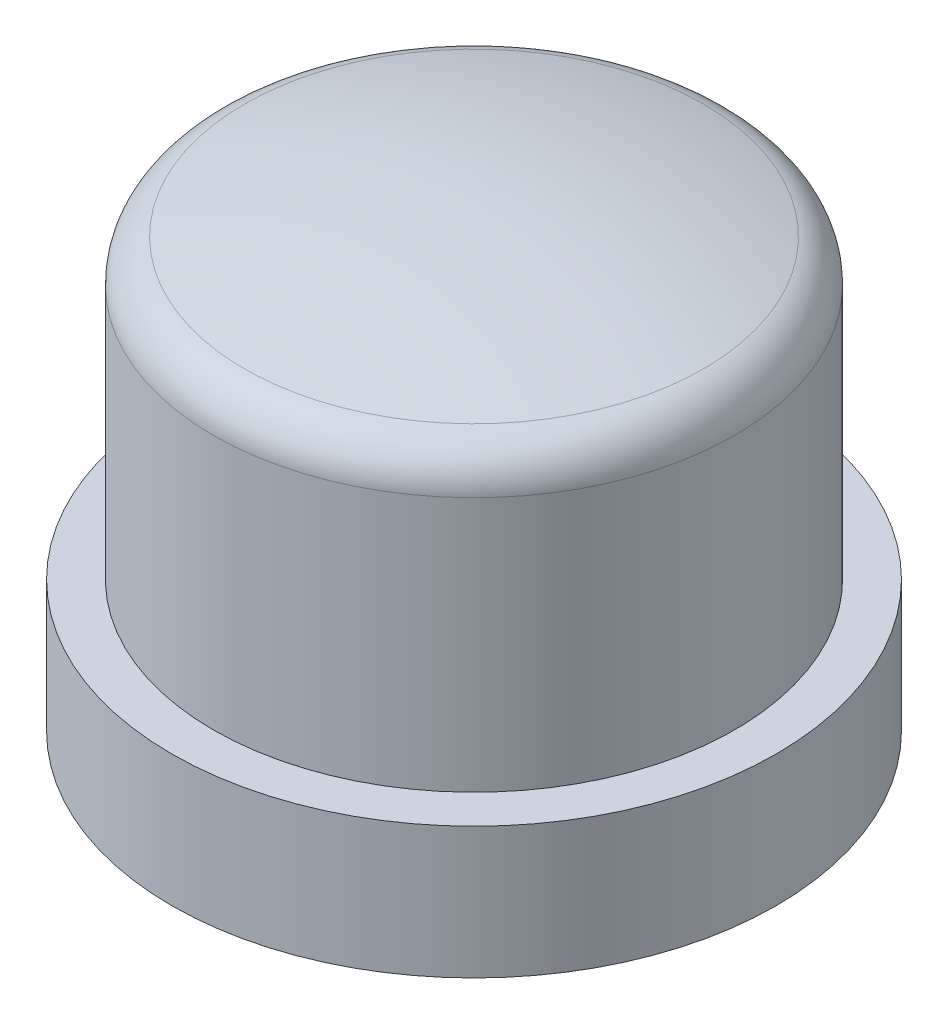
ISO-10303-21;
HEADER;
FILE_DESCRIPTION(('STEP AP214'),'2;1');
FILE_NAME('part.step','',(''),(''),'','','');
FILE_SCHEMA(('AUTOMOTIVE_DESIGN { 1 0 10303 214 1 1 1 1 }'));
ENDSEC;
DATA;
#1=APPLICATION_CONTEXT('core data for automotive mechanical design processes');
#2=APPLICATION_PROTOCOL_DEFINITION('international standard','automotive_design',2000,#1);
#3=PRODUCT_CONTEXT('',#1,'mechanical');
#4=PRODUCT('Part','Part','',(#3));
#5=PRODUCT_RELATED_PRODUCT_CATEGORY('part','',(#4));
#6=PRODUCT_DEFINITION_FORMATION('','',#4);
#7=PRODUCT_DEFINITION_CONTEXT('part definition',#1,'design');
#8=PRODUCT_DEFINITION('design','',#6,#7);
#9=PRODUCT_DEFINITION_SHAPE('','',#8);
#10=(LENGTH_UNIT() NAMED_UNIT(*) SI_UNIT(.MILLI.,.METRE.));
#11=(NAMED_UNIT(*) PLANE_ANGLE_UNIT() SI_UNIT($,.RADIAN.));
#12=(NAMED_UNIT(*) SI_UNIT($,.STERADIAN.) SOLID_ANGLE_UNIT());
#13=UNCERTAINTY_MEASURE_WITH_UNIT(LENGTH_MEASURE(1.E-05),#10,'distance_accuracy_value','');
#14=(GEOMETRIC_REPRESENTATION_CONTEXT(3) GLOBAL_UNCERTAINTY_ASSIGNED_CONTEXT((#13)) GLOBAL_UNIT_ASSIGNED_CONTEXT((#10,
#11,#12)) REPRESENTATION_CONTEXT('',''));
#15=CARTESIAN_POINT('',(0.,0.,0.));
#16=DIRECTION('',(0.,0.,1.));
#17=DIRECTION('',(1.,0.,0.));
#18=AXIS2_PLACEMENT_3D('',#15,#16,#17);
#19=CARTESIAN_POINT('',(0.,-6.36455702250021,0.));
#20=DIRECTION('',(0.,0.,1.));
#21=DIRECTION('',(1.,0.,0.));
#22=AXIS2_PLACEMENT_3D('',#19,#20,#21);
#23=SPHERICAL_SURFACE('',#22,9.100625);
#24=CARTESIAN_POINT('',(0.,-6.36455702250021,0.));
#25=DIRECTION('',(0.,-1.,0.));
#26=DIRECTION('',(0.,0.,-1.));
#27=AXIS2_PLACEMENT_3D('',#24,#25,#26);
#28=SPHERICAL_SURFACE('',#27,9.100625);
#29=CARTESIAN_POINT('',(0.,2.35110803030138,0.));
#30=DIRECTION('',(0.,-1.,0.));
#31=DIRECTION('',(0.,0.,-1.));
#32=AXIS2_PLACEMENT_3D('',#29,#30,#31);
#33=CIRCLE('',#32,2.61888489208633);
#34=CARTESIAN_POINT('',(0.,2.35110803030138,-2.61888489208633));
#35=VERTEX_POINT('',#34);
#36=EDGE_CURVE('E11',#35,#35,#33,.F.);
#37=ORIENTED_EDGE('',*,*,#36,.T.);
#38=EDGE_LOOP('',(#37));
#39=FACE_BOUND('',#38,.T.);
#40=ADVANCED_FACE('F33',(#39),#28,.T.);
#41=CARTESIAN_POINT('',(0.,1.23606797749979,0.));
#42=DIRECTION('',(0.,-1.,0.));
#43=DIRECTION('',(0.,0.,-1.));
#44=AXIS2_PLACEMENT_3D('',#41,#42,#43);
#45=CYLINDRICAL_SURFACE('',#44,2.975);
#46=CARTESIAN_POINT('',(0.,1.87225822312871,0.));
#47=DIRECTION('',(0.,-1.,0.));
#48=DIRECTION('',(0.,0.,-1.));
#49=AXIS2_PLACEMENT_3D('',#46,#47,#48);
#50=CIRCLE('',#49,2.975);
#51=CARTESIAN_POINT('',(0.,1.87225822312871,-2.975));
#52=VERTEX_POINT('',#51);
#53=EDGE_CURVE('E41',#52,#52,#50,.T.);
#54=ORIENTED_EDGE('',*,*,#53,.T.);
#55=EDGE_LOOP('',(#54));
#56=FACE_BOUND('',#55,.T.);
#57=CARTESIAN_POINT('',(0.,-1.03915126256106,0.));
#58=DIRECTION('',(0.,1.,0.));
#59=DIRECTION('',(0.,0.,1.));
#60=AXIS2_PLACEMENT_3D('',#57,#58,#59);
#61=CIRCLE('',#60,2.975);
#62=CARTESIAN_POINT('',(0.,-1.03915126256106,2.975));
#63=VERTEX_POINT('',#62);
#64=EDGE_CURVE('E46',#63,#63,#61,.F.);
#65=ORIENTED_EDGE('',*,*,#64,.F.);
#66=EDGE_LOOP('',(#65));
#67=FACE_BOUND('',#66,.T.);
#68=ADVANCED_FACE('F68',(#56,#67),#45,.T.);
#69=CARTESIAN_POINT('',(0.,-1.03915126256106,-3.));
#70=DIRECTION('',(0.,1.,0.));
#71=DIRECTION('',(0.,0.,1.));
#72=AXIS2_PLACEMENT_3D('',#69,#70,#71);
#73=PLANE('',#72);
#74=ORIENTED_EDGE('',*,*,#64,.T.);
#75=EDGE_LOOP('',(#74));
#76=FACE_BOUND('',#75,.T.);
#77=CARTESIAN_POINT('',(0.,-1.03915126256106,0.));
#78=DIRECTION('',(0.,1.,0.));
#79=DIRECTION('',(0.,0.,1.));
#80=AXIS2_PLACEMENT_3D('',#77,#78,#79);
#81=CIRCLE('',#80,3.45);
#82=CARTESIAN_POINT('',(0.,-1.03915126256106,3.45));
#83=VERTEX_POINT('',#82);
#84=EDGE_CURVE('E49',#83,#83,#81,.F.);
#85=ORIENTED_EDGE('',*,*,#84,.F.);
#86=EDGE_LOOP('',(#85));
#87=FACE_BOUND('',#86,.T.);
#88=ADVANCED_FACE('F60',(#76,#87),#73,.T.);
#89=CARTESIAN_POINT('',(0.,1.23606797749979,0.));
#90=DIRECTION('',(0.,-1.,0.));
#91=DIRECTION('',(0.,0.,-1.));
#92=AXIS2_PLACEMENT_3D('',#89,#90,#91);
#93=CYLINDRICAL_SURFACE('',#92,3.45);
#94=ORIENTED_EDGE('',*,*,#84,.T.);
#95=EDGE_LOOP('',(#94));
#96=FACE_BOUND('',#95,.T.);
#97=CARTESIAN_POINT('',(0.,-2.53915126256106,0.));
#98=DIRECTION('',(0.,-1.,0.));
#99=DIRECTION('',(0.,0.,-1.));
#100=AXIS2_PLACEMENT_3D('',#97,#98,#99);
#101=CIRCLE('',#100,3.45);
#102=CARTESIAN_POINT('',(0.,-2.53915126256106,-3.45));
#103=VERTEX_POINT('',#102);
#104=EDGE_CURVE('E37',#103,#103,#101,.T.);
#105=ORIENTED_EDGE('',*,*,#104,.F.);
#106=EDGE_LOOP('',(#105));
#107=FACE_BOUND('',#106,.T.);
#108=ADVANCED_FACE('F35',(#96,#107),#93,.T.);
#109=CARTESIAN_POINT('',(0.,-2.53915126256106,-3.5));
#110=DIRECTION('',(0.,-1.,0.));
#111=DIRECTION('',(0.,0.,-1.));
#112=AXIS2_PLACEMENT_3D('',#109,#110,#111);
#113=PLANE('',#112);
#114=ORIENTED_EDGE('',*,*,#104,.T.);
#115=EDGE_LOOP('',(#114));
#116=FACE_BOUND('',#115,.T.);
#117=ADVANCED_FACE('F57',(#116),#113,.T.);
#118=CARTESIAN_POINT('',(0.,1.87225822312871,0.));
#119=DIRECTION('',(0.,-1.,0.));
#120=DIRECTION('',(0.,0.,-1.));
#121=AXIS2_PLACEMENT_3D('',#118,#119,#120);
#122=TOROIDAL_SURFACE('',#121,2.475,0.5);
#123=ORIENTED_EDGE('',*,*,#36,.F.);
#124=EDGE_LOOP('',(#123));
#125=FACE_BOUND('',#124,.T.);
#126=ORIENTED_EDGE('',*,*,#53,.F.);
#127=EDGE_LOOP('',(#126));
#128=FACE_BOUND('',#127,.T.);
#129=ADVANCED_FACE('F66',(#125,#128),#122,.T.);
#130=CLOSED_SHELL('',(#40,#68,#88,#108,#117,#129));
#131=MANIFOLD_SOLID_BREP('B2',#130);
#132=ADVANCED_BREP_SHAPE_REPRESENTATION('',(#18,#131),#14);
#133=SHAPE_DEFINITION_REPRESENTATION(#9,#132);
ENDSEC;
END-ISO-10303-21;
